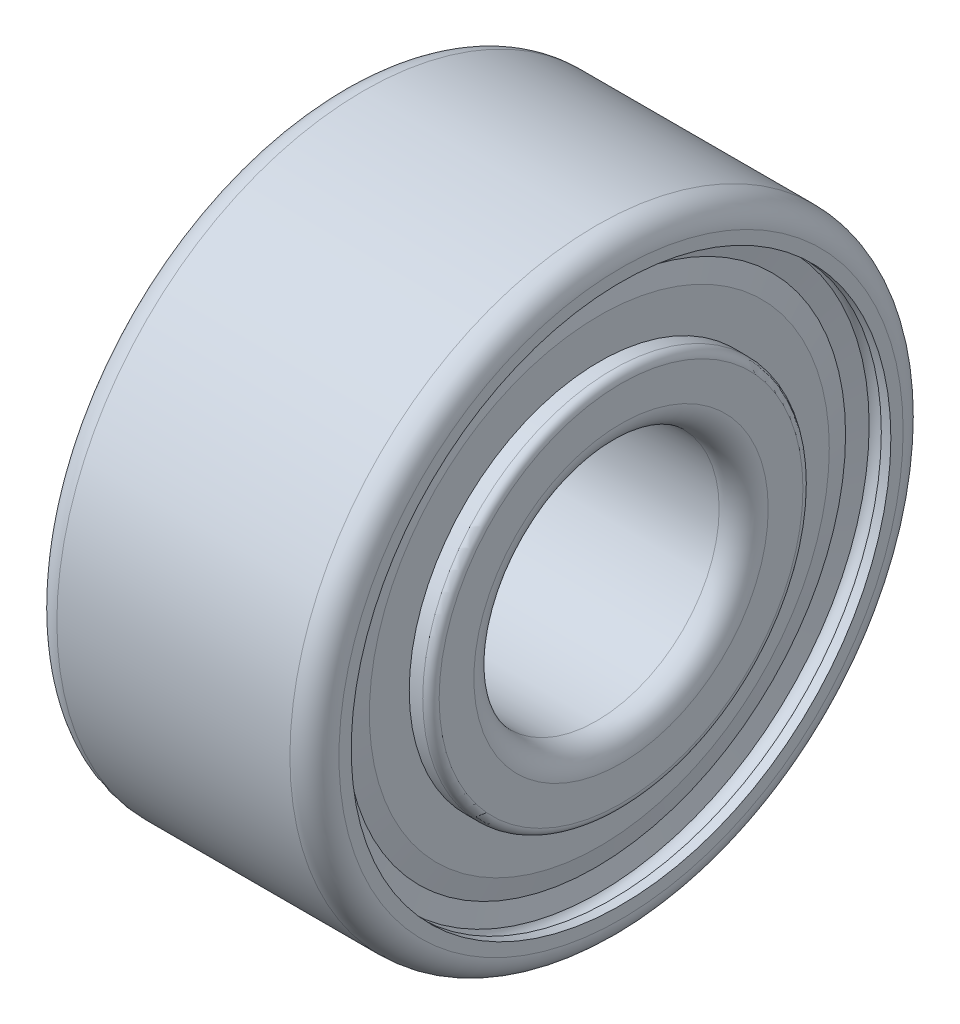
ISO-10303-21;
HEADER;
FILE_DESCRIPTION(('STEP AP214'),'2;1');
FILE_NAME('part.step','',(''),(''),'','','');
FILE_SCHEMA(('AUTOMOTIVE_DESIGN { 1 0 10303 214 1 1 1 1 }'));
ENDSEC;
DATA;
#1=APPLICATION_CONTEXT('core data for automotive mechanical design processes');
#2=APPLICATION_PROTOCOL_DEFINITION('international standard','automotive_design',2000,#1);
#3=PRODUCT_CONTEXT('',#1,'mechanical');
#4=PRODUCT('Part','Part','',(#3));
#5=PRODUCT_RELATED_PRODUCT_CATEGORY('part','',(#4));
#6=PRODUCT_DEFINITION_FORMATION('','',#4);
#7=PRODUCT_DEFINITION_CONTEXT('part definition',#1,'design');
#8=PRODUCT_DEFINITION('design','',#6,#7);
#9=PRODUCT_DEFINITION_SHAPE('','',#8);
#10=(LENGTH_UNIT() NAMED_UNIT(*) SI_UNIT(.MILLI.,.METRE.));
#11=(NAMED_UNIT(*) PLANE_ANGLE_UNIT() SI_UNIT($,.RADIAN.));
#12=(NAMED_UNIT(*) SI_UNIT($,.STERADIAN.) SOLID_ANGLE_UNIT());
#13=UNCERTAINTY_MEASURE_WITH_UNIT(LENGTH_MEASURE(1.E-05),#10,'distance_accuracy_value','');
#14=(GEOMETRIC_REPRESENTATION_CONTEXT(3) GLOBAL_UNCERTAINTY_ASSIGNED_CONTEXT((#13)) GLOBAL_UNIT_ASSIGNED_CONTEXT((#10,
#11,#12)) REPRESENTATION_CONTEXT('',''));
#15=CARTESIAN_POINT('',(0.,0.,0.));
#16=DIRECTION('',(0.,0.,1.));
#17=DIRECTION('',(1.,0.,0.));
#18=AXIS2_PLACEMENT_3D('',#15,#16,#17);
#19=CARTESIAN_POINT('',(2.0635,0.,0.));
#20=DIRECTION('',(1.,0.,0.));
#21=DIRECTION('',(0.,0.,-1.));
#22=AXIS2_PLACEMENT_3D('',#19,#20,#21);
#23=CONICAL_SURFACE('',#22,2.2,1.24961557878949);
#24=CARTESIAN_POINT('',(2.004,0.,0.));
#25=DIRECTION('',(1.,0.,0.));
#26=DIRECTION('',(0.,0.,-1.));
#27=AXIS2_PLACEMENT_3D('',#24,#25,#26);
#28=CIRCLE('',#27,2.0211603846154);
#29=CARTESIAN_POINT('',(2.004,0.,-2.0211603846154));
#30=VERTEX_POINT('',#29);
#31=EDGE_CURVE('P0_E10',#30,#30,#28,.T.);
#32=ORIENTED_EDGE('',*,*,#31,.T.);
#33=EDGE_LOOP('',(#32));
#34=FACE_BOUND('',#33,.T.);
#35=CARTESIAN_POINT('',(2.0635,0.,0.));
#36=DIRECTION('',(1.,0.,0.));
#37=DIRECTION('',(0.,0.,-1.));
#38=AXIS2_PLACEMENT_3D('',#35,#36,#37);
#39=CIRCLE('',#38,2.2);
#40=CARTESIAN_POINT('',(2.0635,0.,-2.2));
#41=VERTEX_POINT('',#40);
#42=EDGE_CURVE('P0_E43',#41,#41,#39,.T.);
#43=ORIENTED_EDGE('',*,*,#42,.F.);
#44=EDGE_LOOP('',(#43));
#45=FACE_BOUND('',#44,.T.);
#46=ADVANCED_FACE('P0_F15',(#34,#45),#23,.T.);
#47=CARTESIAN_POINT('',(2.004,2.0211603846154,0.));
#48=DIRECTION('',(-1.,0.,0.));
#49=DIRECTION('',(0.,0.,1.));
#50=AXIS2_PLACEMENT_3D('',#47,#48,#49);
#51=PLANE('',#50);
#52=CARTESIAN_POINT('',(2.004,0.,0.));
#53=DIRECTION('',(1.,0.,0.));
#54=DIRECTION('',(0.,0.,-1.));
#55=AXIS2_PLACEMENT_3D('',#52,#53,#54);
#56=CIRCLE('',#55,1.875);
#57=CARTESIAN_POINT('',(2.004,0.,-1.875));
#58=VERTEX_POINT('',#57);
#59=EDGE_CURVE('P0_E21',#58,#58,#56,.T.);
#60=ORIENTED_EDGE('',*,*,#59,.T.);
#61=EDGE_LOOP('',(#60));
#62=FACE_BOUND('',#61,.T.);
#63=ORIENTED_EDGE('',*,*,#31,.F.);
#64=EDGE_LOOP('',(#63));
#65=FACE_BOUND('',#64,.T.);
#66=ADVANCED_FACE('P0_F51',(#62,#65),#51,.T.);
#67=CARTESIAN_POINT('',(2.004,0.,0.));
#68=DIRECTION('',(-1.,0.,0.));
#69=DIRECTION('',(0.,0.,1.));
#70=AXIS2_PLACEMENT_3D('',#67,#68,#69);
#71=CONICAL_SURFACE('',#70,1.875,1.38972463594285);
#72=CARTESIAN_POINT('',(2.0635,0.,0.));
#73=DIRECTION('',(1.,0.,0.));
#74=DIRECTION('',(0.,0.,-1.));
#75=AXIS2_PLACEMENT_3D('',#72,#73,#74);
#76=CIRCLE('',#75,1.55);
#77=CARTESIAN_POINT('',(2.0635,0.,-1.55));
#78=VERTEX_POINT('',#77);
#79=EDGE_CURVE('P0_E25',#78,#78,#76,.T.);
#80=ORIENTED_EDGE('',*,*,#79,.T.);
#81=EDGE_LOOP('',(#80));
#82=FACE_BOUND('',#81,.T.);
#83=ORIENTED_EDGE('',*,*,#59,.F.);
#84=EDGE_LOOP('',(#83));
#85=FACE_BOUND('',#84,.T.);
#86=ADVANCED_FACE('P0_F56',(#82,#85),#71,.F.);
#87=CARTESIAN_POINT('',(50.,0.,0.));
#88=DIRECTION('',(1.,0.,0.));
#89=DIRECTION('',(0.,0.,-1.));
#90=AXIS2_PLACEMENT_3D('',#87,#88,#89);
#91=CYLINDRICAL_SURFACE('',#90,1.55);
#92=CARTESIAN_POINT('',(2.123,0.,0.));
#93=DIRECTION('',(1.,0.,0.));
#94=DIRECTION('',(0.,0.,-1.));
#95=AXIS2_PLACEMENT_3D('',#92,#93,#94);
#96=CIRCLE('',#95,1.55);
#97=CARTESIAN_POINT('',(2.123,0.,-1.55));
#98=VERTEX_POINT('',#97);
#99=EDGE_CURVE('P0_E29',#98,#98,#96,.T.);
#100=ORIENTED_EDGE('',*,*,#99,.T.);
#101=EDGE_LOOP('',(#100));
#102=FACE_BOUND('',#101,.T.);
#103=ORIENTED_EDGE('',*,*,#79,.F.);
#104=EDGE_LOOP('',(#103));
#105=FACE_BOUND('',#104,.T.);
#106=ADVANCED_FACE('P0_F60',(#102,#105),#91,.F.);
#107=CARTESIAN_POINT('',(2.123,1.55,0.));
#108=DIRECTION('',(1.,0.,0.));
#109=DIRECTION('',(0.,0.,-1.));
#110=AXIS2_PLACEMENT_3D('',#107,#108,#109);
#111=PLANE('',#110);
#112=CARTESIAN_POINT('',(2.123,0.,0.));
#113=DIRECTION('',(1.,0.,0.));
#114=DIRECTION('',(0.,0.,-1.));
#115=AXIS2_PLACEMENT_3D('',#112,#113,#114);
#116=CIRCLE('',#115,1.875);
#117=CARTESIAN_POINT('',(2.123,0.,-1.875));
#118=VERTEX_POINT('',#117);
#119=EDGE_CURVE('P0_E34',#118,#118,#116,.T.);
#120=ORIENTED_EDGE('',*,*,#119,.T.);
#121=EDGE_LOOP('',(#120));
#122=FACE_BOUND('',#121,.T.);
#123=ORIENTED_EDGE('',*,*,#99,.F.);
#124=EDGE_LOOP('',(#123));
#125=FACE_BOUND('',#124,.T.);
#126=ADVANCED_FACE('P0_F67',(#122,#125),#111,.T.);
#127=CARTESIAN_POINT('',(2.123,0.,0.));
#128=DIRECTION('',(-1.,0.,0.));
#129=DIRECTION('',(0.,0.,1.));
#130=AXIS2_PLACEMENT_3D('',#127,#128,#129);
#131=CONICAL_SURFACE('',#130,1.875,1.38972463594285);
#132=CARTESIAN_POINT('',(2.09325,0.,0.));
#133=DIRECTION('',(1.,0.,0.));
#134=DIRECTION('',(0.,0.,-1.));
#135=AXIS2_PLACEMENT_3D('',#132,#133,#134);
#136=CIRCLE('',#135,2.0375);
#137=CARTESIAN_POINT('',(2.09325,0.,-2.0375));
#138=VERTEX_POINT('',#137);
#139=EDGE_CURVE('P0_E37',#138,#138,#136,.T.);
#140=ORIENTED_EDGE('',*,*,#139,.T.);
#141=EDGE_LOOP('',(#140));
#142=FACE_BOUND('',#141,.T.);
#143=ORIENTED_EDGE('',*,*,#119,.F.);
#144=EDGE_LOOP('',(#143));
#145=FACE_BOUND('',#144,.T.);
#146=ADVANCED_FACE('P0_F71',(#142,#145),#131,.T.);
#147=CARTESIAN_POINT('',(2.09325,0.,0.));
#148=DIRECTION('',(1.,0.,0.));
#149=DIRECTION('',(0.,0.,-1.));
#150=AXIS2_PLACEMENT_3D('',#147,#148,#149);
#151=CONICAL_SURFACE('',#150,2.0375,1.38972463594285);
#152=CARTESIAN_POINT('',(2.123,0.,0.));
#153=DIRECTION('',(1.,0.,0.));
#154=DIRECTION('',(0.,0.,-1.));
#155=AXIS2_PLACEMENT_3D('',#152,#153,#154);
#156=CIRCLE('',#155,2.2);
#157=CARTESIAN_POINT('',(2.123,0.,-2.2));
#158=VERTEX_POINT('',#157);
#159=EDGE_CURVE('P0_E40',#158,#158,#156,.T.);
#160=ORIENTED_EDGE('',*,*,#159,.T.);
#161=EDGE_LOOP('',(#160));
#162=FACE_BOUND('',#161,.T.);
#163=ORIENTED_EDGE('',*,*,#139,.F.);
#164=EDGE_LOOP('',(#163));
#165=FACE_BOUND('',#164,.T.);
#166=ADVANCED_FACE('P0_F75',(#162,#165),#151,.F.);
#167=CARTESIAN_POINT('',(50.,0.,0.));
#168=DIRECTION('',(1.,0.,0.));
#169=DIRECTION('',(0.,0.,-1.));
#170=AXIS2_PLACEMENT_3D('',#167,#168,#169);
#171=CYLINDRICAL_SURFACE('',#170,2.2);
#172=ORIENTED_EDGE('',*,*,#42,.T.);
#173=EDGE_LOOP('',(#172));
#174=FACE_BOUND('',#173,.T.);
#175=ORIENTED_EDGE('',*,*,#159,.F.);
#176=EDGE_LOOP('',(#175));
#177=FACE_BOUND('',#176,.T.);
#178=ADVANCED_FACE('P0_F47',(#174,#177),#171,.T.);
#179=CLOSED_SHELL('',(#46,#66,#86,#106,#126,#146,#166,#178));
#180=MANIFOLD_SOLID_BREP('P0_B1',#179);
#181=CARTESIAN_POINT('',(0.200000000000017,0.,0.));
#182=DIRECTION('',(1.,0.,0.));
#183=DIRECTION('',(0.,0.,-1.));
#184=AXIS2_PLACEMENT_3D('',#181,#182,#183);
#185=TOROIDAL_SURFACE('',#184,1.20000000000002,0.200000000000017);
#186=CARTESIAN_POINT('',(0.2,0.,0.));
#187=DIRECTION('',(1.,0.,0.));
#188=DIRECTION('',(0.,0.,-1.));
#189=AXIS2_PLACEMENT_3D('',#186,#187,#188);
#190=CIRCLE('',#189,1.);
#191=CARTESIAN_POINT('',(0.2,0.,-1.));
#192=VERTEX_POINT('',#191);
#193=EDGE_CURVE('P1_E10',#192,#192,#190,.T.);
#194=ORIENTED_EDGE('',*,*,#193,.T.);
#195=EDGE_LOOP('',(#194));
#196=FACE_BOUND('',#195,.T.);
#197=CARTESIAN_POINT('',(0.,0.,0.));
#198=DIRECTION('',(1.,0.,0.));
#199=DIRECTION('',(0.,0.,-1.));
#200=AXIS2_PLACEMENT_3D('',#197,#198,#199);
#201=CIRCLE('',#200,1.2);
#202=CARTESIAN_POINT('',(0.,0.,-1.2));
#203=VERTEX_POINT('',#202);
#204=EDGE_CURVE('P1_E49',#203,#203,#201,.T.);
#205=ORIENTED_EDGE('',*,*,#204,.F.);
#206=EDGE_LOOP('',(#205));
#207=FACE_BOUND('',#206,.T.);
#208=ADVANCED_FACE('P1_F15',(#196,#207),#185,.T.);
#209=CARTESIAN_POINT('',(2.1,0.,0.));
#210=DIRECTION('',(1.,0.,0.));
#211=DIRECTION('',(0.,0.,-1.));
#212=AXIS2_PLACEMENT_3D('',#209,#210,#211);
#213=CYLINDRICAL_SURFACE('',#212,1.);
#214=CARTESIAN_POINT('',(2.1,0.,0.));
#215=DIRECTION('',(1.,0.,0.));
#216=DIRECTION('',(0.,0.,-1.));
#217=AXIS2_PLACEMENT_3D('',#214,#215,#216);
#218=CIRCLE('',#217,1.);
#219=CARTESIAN_POINT('',(2.1,0.,-1.));
#220=VERTEX_POINT('',#219);
#221=EDGE_CURVE('P1_E21',#220,#220,#218,.T.);
#222=ORIENTED_EDGE('',*,*,#221,.T.);
#223=EDGE_LOOP('',(#222));
#224=FACE_BOUND('',#223,.T.);
#225=ORIENTED_EDGE('',*,*,#193,.F.);
#226=EDGE_LOOP('',(#225));
#227=FACE_BOUND('',#226,.T.);
#228=ADVANCED_FACE('P1_F57',(#224,#227),#213,.F.);
#229=CARTESIAN_POINT('',(2.09999999999997,0.,0.));
#230=DIRECTION('',(1.,0.,0.));
#231=DIRECTION('',(0.,0.,-1.));
#232=AXIS2_PLACEMENT_3D('',#229,#230,#231);
#233=TOROIDAL_SURFACE('',#232,1.20000000000003,0.200000000000032);
#234=CARTESIAN_POINT('',(2.3,0.,0.));
#235=DIRECTION('',(1.,0.,0.));
#236=DIRECTION('',(0.,0.,-1.));
#237=AXIS2_PLACEMENT_3D('',#234,#235,#236);
#238=CIRCLE('',#237,1.2);
#239=CARTESIAN_POINT('',(2.3,0.,-1.2));
#240=VERTEX_POINT('',#239);
#241=EDGE_CURVE('P1_E25',#240,#240,#238,.T.);
#242=ORIENTED_EDGE('',*,*,#241,.T.);
#243=EDGE_LOOP('',(#242));
#244=FACE_BOUND('',#243,.T.);
#245=ORIENTED_EDGE('',*,*,#221,.F.);
#246=EDGE_LOOP('',(#245));
#247=FACE_BOUND('',#246,.T.);
#248=ADVANCED_FACE('P1_F62',(#244,#247),#233,.T.);
#249=CARTESIAN_POINT('',(2.3,1.2,0.));
#250=DIRECTION('',(1.,0.,0.));
#251=DIRECTION('',(0.,0.,-1.));
#252=AXIS2_PLACEMENT_3D('',#249,#250,#251);
#253=PLANE('',#252);
#254=CARTESIAN_POINT('',(2.3,0.,0.));
#255=DIRECTION('',(1.,0.,0.));
#256=DIRECTION('',(0.,0.,-1.));
#257=AXIS2_PLACEMENT_3D('',#254,#255,#256);
#258=CIRCLE('',#257,1.483);
#259=CARTESIAN_POINT('',(2.3,0.,-1.483));
#260=VERTEX_POINT('',#259);
#261=EDGE_CURVE('P1_E29',#260,#260,#258,.T.);
#262=ORIENTED_EDGE('',*,*,#261,.T.);
#263=EDGE_LOOP('',(#262));
#264=FACE_BOUND('',#263,.T.);
#265=ORIENTED_EDGE('',*,*,#241,.F.);
#266=EDGE_LOOP('',(#265));
#267=FACE_BOUND('',#266,.T.);
#268=ADVANCED_FACE('P1_F66',(#264,#267),#253,.T.);
#269=CARTESIAN_POINT('',(2.233,0.,0.));
#270=DIRECTION('',(1.,0.,0.));
#271=DIRECTION('',(0.,0.,-1.));
#272=AXIS2_PLACEMENT_3D('',#269,#270,#271);
#273=TOROIDAL_SURFACE('',#272,1.483,0.0669999999999951);
#274=CARTESIAN_POINT('',(2.233,0.,0.));
#275=DIRECTION('',(1.,0.,0.));
#276=DIRECTION('',(0.,0.,-1.));
#277=AXIS2_PLACEMENT_3D('',#274,#275,#276);
#278=CIRCLE('',#277,1.55);
#279=CARTESIAN_POINT('',(2.233,0.,-1.55));
#280=VERTEX_POINT('',#279);
#281=EDGE_CURVE('P1_E34',#280,#280,#278,.T.);
#282=ORIENTED_EDGE('',*,*,#281,.T.);
#283=EDGE_LOOP('',(#282));
#284=FACE_BOUND('',#283,.T.);
#285=ORIENTED_EDGE('',*,*,#261,.F.);
#286=EDGE_LOOP('',(#285));
#287=FACE_BOUND('',#286,.T.);
#288=ADVANCED_FACE('P1_F73',(#284,#287),#273,.T.);
#289=CARTESIAN_POINT('',(2.1,0.,0.));
#290=DIRECTION('',(1.,0.,0.));
#291=DIRECTION('',(0.,0.,-1.));
#292=AXIS2_PLACEMENT_3D('',#289,#290,#291);
#293=CYLINDRICAL_SURFACE('',#292,1.55);
#294=CARTESIAN_POINT('',(1.5372983346207,0.,0.));
#295=DIRECTION('',(1.,0.,0.));
#296=DIRECTION('',(0.,0.,-1.));
#297=AXIS2_PLACEMENT_3D('',#294,#295,#296);
#298=CIRCLE('',#297,1.55);
#299=CARTESIAN_POINT('',(1.5372983346207,0.,-1.55));
#300=VERTEX_POINT('',#299);
#301=EDGE_CURVE('P1_E37',#300,#300,#298,.T.);
#302=ORIENTED_EDGE('',*,*,#301,.T.);
#303=EDGE_LOOP('',(#302));
#304=FACE_BOUND('',#303,.T.);
#305=ORIENTED_EDGE('',*,*,#281,.F.);
#306=EDGE_LOOP('',(#305));
#307=FACE_BOUND('',#306,.T.);
#308=ADVANCED_FACE('P1_F77',(#304,#307),#293,.T.);
#309=CARTESIAN_POINT('',(1.14999999999998,0.,0.));
#310=DIRECTION('',(1.,0.,0.));
#311=DIRECTION('',(0.,0.,-1.));
#312=AXIS2_PLACEMENT_3D('',#309,#310,#311);
#313=TOROIDAL_SURFACE('',#312,1.64999999999997,0.399999999999972);
#314=CARTESIAN_POINT('',(0.76270166537926,0.,0.));
#315=DIRECTION('',(1.,0.,0.));
#316=DIRECTION('',(0.,0.,-1.));
#317=AXIS2_PLACEMENT_3D('',#314,#315,#316);
#318=CIRCLE('',#317,1.55);
#319=CARTESIAN_POINT('',(0.76270166537926,0.,-1.55));
#320=VERTEX_POINT('',#319);
#321=EDGE_CURVE('P1_E40',#320,#320,#318,.T.);
#322=ORIENTED_EDGE('',*,*,#321,.T.);
#323=EDGE_LOOP('',(#322));
#324=FACE_BOUND('',#323,.T.);
#325=ORIENTED_EDGE('',*,*,#301,.F.);
#326=EDGE_LOOP('',(#325));
#327=FACE_BOUND('',#326,.T.);
#328=ADVANCED_FACE('P1_F81',(#324,#327),#313,.F.);
#329=CARTESIAN_POINT('',(2.1,0.,0.));
#330=DIRECTION('',(1.,0.,0.));
#331=DIRECTION('',(0.,0.,-1.));
#332=AXIS2_PLACEMENT_3D('',#329,#330,#331);
#333=CYLINDRICAL_SURFACE('',#332,1.55);
#334=CARTESIAN_POINT('',(0.0669999999999998,0.,0.));
#335=DIRECTION('',(1.,0.,0.));
#336=DIRECTION('',(0.,0.,-1.));
#337=AXIS2_PLACEMENT_3D('',#334,#335,#336);
#338=CIRCLE('',#337,1.55);
#339=CARTESIAN_POINT('',(0.0669999999999998,0.,-1.55));
#340=VERTEX_POINT('',#339);
#341=EDGE_CURVE('P1_E43',#340,#340,#338,.T.);
#342=ORIENTED_EDGE('',*,*,#341,.T.);
#343=EDGE_LOOP('',(#342));
#344=FACE_BOUND('',#343,.T.);
#345=ORIENTED_EDGE('',*,*,#321,.F.);
#346=EDGE_LOOP('',(#345));
#347=FACE_BOUND('',#346,.T.);
#348=ADVANCED_FACE('P1_F85',(#344,#347),#333,.T.);
#349=CARTESIAN_POINT('',(0.0669999999999973,0.,0.));
#350=DIRECTION('',(1.,0.,0.));
#351=DIRECTION('',(0.,0.,-1.));
#352=AXIS2_PLACEMENT_3D('',#349,#350,#351);
#353=TOROIDAL_SURFACE('',#352,1.483,0.0669999999999973);
#354=CARTESIAN_POINT('',(0.,0.,0.));
#355=DIRECTION('',(1.,0.,0.));
#356=DIRECTION('',(0.,0.,-1.));
#357=AXIS2_PLACEMENT_3D('',#354,#355,#356);
#358=CIRCLE('',#357,1.483);
#359=CARTESIAN_POINT('',(0.,0.,-1.483));
#360=VERTEX_POINT('',#359);
#361=EDGE_CURVE('P1_E46',#360,#360,#358,.T.);
#362=ORIENTED_EDGE('',*,*,#361,.T.);
#363=EDGE_LOOP('',(#362));
#364=FACE_BOUND('',#363,.T.);
#365=ORIENTED_EDGE('',*,*,#341,.F.);
#366=EDGE_LOOP('',(#365));
#367=FACE_BOUND('',#366,.T.);
#368=ADVANCED_FACE('P1_F89',(#364,#367),#353,.T.);
#369=CARTESIAN_POINT('',(0.,1.483,0.));
#370=DIRECTION('',(-1.,0.,0.));
#371=DIRECTION('',(0.,0.,1.));
#372=AXIS2_PLACEMENT_3D('',#369,#370,#371);
#373=PLANE('',#372);
#374=ORIENTED_EDGE('',*,*,#204,.T.);
#375=EDGE_LOOP('',(#374));
#376=FACE_BOUND('',#375,.T.);
#377=ORIENTED_EDGE('',*,*,#361,.F.);
#378=EDGE_LOOP('',(#377));
#379=FACE_BOUND('',#378,.T.);
#380=ADVANCED_FACE('P1_F53',(#376,#379),#373,.T.);
#381=CLOSED_SHELL('',(#208,#228,#248,#268,#288,#308,#328,#348,#368,#380));
#382=MANIFOLD_SOLID_BREP('P1_B1',#381);
#383=CARTESIAN_POINT('',(0.178,1.875,0.));
#384=DIRECTION('',(1.,0.,0.));
#385=DIRECTION('',(0.,0.,-1.));
#386=AXIS2_PLACEMENT_3D('',#383,#384,#385);
#387=PLANE('',#386);
#388=CARTESIAN_POINT('',(0.178,0.,0.));
#389=DIRECTION('',(-1.,0.,0.));
#390=DIRECTION('',(0.,0.,1.));
#391=AXIS2_PLACEMENT_3D('',#388,#389,#390);
#392=CIRCLE('',#391,1.55);
#393=CARTESIAN_POINT('',(0.178,0.,1.55));
#394=VERTEX_POINT('',#393);
#395=EDGE_CURVE('P2_E10',#394,#394,#392,.T.);
#396=ORIENTED_EDGE('',*,*,#395,.F.);
#397=EDGE_LOOP('',(#396));
#398=FACE_BOUND('',#397,.T.);
#399=CARTESIAN_POINT('',(0.178,0.,0.));
#400=DIRECTION('',(-1.,0.,0.));
#401=DIRECTION('',(0.,0.,1.));
#402=AXIS2_PLACEMENT_3D('',#399,#400,#401);
#403=CIRCLE('',#402,1.875);
#404=CARTESIAN_POINT('',(0.178,0.,1.875));
#405=VERTEX_POINT('',#404);
#406=EDGE_CURVE('P2_E43',#405,#405,#403,.T.);
#407=ORIENTED_EDGE('',*,*,#406,.T.);
#408=EDGE_LOOP('',(#407));
#409=FACE_BOUND('',#408,.T.);
#410=ADVANCED_FACE('P2_F15',(#398,#409),#387,.F.);
#411=CARTESIAN_POINT('',(0.2375,0.,0.));
#412=DIRECTION('',(-1.,0.,0.));
#413=DIRECTION('',(0.,0.,1.));
#414=AXIS2_PLACEMENT_3D('',#411,#412,#413);
#415=CYLINDRICAL_SURFACE('',#414,1.55);
#416=CARTESIAN_POINT('',(0.2375,0.,0.));
#417=DIRECTION('',(-1.,0.,0.));
#418=DIRECTION('',(0.,0.,1.));
#419=AXIS2_PLACEMENT_3D('',#416,#417,#418);
#420=CIRCLE('',#419,1.55);
#421=CARTESIAN_POINT('',(0.2375,0.,1.55));
#422=VERTEX_POINT('',#421);
#423=EDGE_CURVE('P2_E21',#422,#422,#420,.T.);
#424=ORIENTED_EDGE('',*,*,#423,.F.);
#425=EDGE_LOOP('',(#424));
#426=FACE_BOUND('',#425,.T.);
#427=ORIENTED_EDGE('',*,*,#395,.T.);
#428=EDGE_LOOP('',(#427));
#429=FACE_BOUND('',#428,.T.);
#430=ADVANCED_FACE('P2_F80',(#426,#429),#415,.F.);
#431=CARTESIAN_POINT('',(0.2375,0.,0.));
#432=DIRECTION('',(1.,0.,0.));
#433=DIRECTION('',(0.,0.,-1.));
#434=AXIS2_PLACEMENT_3D('',#431,#432,#433);
#435=CONICAL_SURFACE('',#434,1.55,1.38972463594286);
#436=CARTESIAN_POINT('',(0.297,0.,0.));
#437=DIRECTION('',(-1.,0.,0.));
#438=DIRECTION('',(0.,0.,1.));
#439=AXIS2_PLACEMENT_3D('',#436,#437,#438);
#440=CIRCLE('',#439,1.875);
#441=CARTESIAN_POINT('',(0.297,0.,1.875));
#442=VERTEX_POINT('',#441);
#443=EDGE_CURVE('P2_E25',#442,#442,#440,.T.);
#444=ORIENTED_EDGE('',*,*,#443,.F.);
#445=EDGE_LOOP('',(#444));
#446=FACE_BOUND('',#445,.T.);
#447=ORIENTED_EDGE('',*,*,#423,.T.);
#448=EDGE_LOOP('',(#447));
#449=FACE_BOUND('',#448,.T.);
#450=ADVANCED_FACE('P2_F75',(#446,#449),#435,.F.);
#451=CARTESIAN_POINT('',(0.297,1.875,0.));
#452=DIRECTION('',(-1.,0.,0.));
#453=DIRECTION('',(0.,0.,1.));
#454=AXIS2_PLACEMENT_3D('',#451,#452,#453);
#455=PLANE('',#454);
#456=CARTESIAN_POINT('',(0.297,0.,0.));
#457=DIRECTION('',(-1.,0.,0.));
#458=DIRECTION('',(0.,0.,1.));
#459=AXIS2_PLACEMENT_3D('',#456,#457,#458);
#460=CIRCLE('',#459,2.0211603846154);
#461=CARTESIAN_POINT('',(0.297,0.,2.0211603846154));
#462=VERTEX_POINT('',#461);
#463=EDGE_CURVE('P2_E29',#462,#462,#460,.T.);
#464=ORIENTED_EDGE('',*,*,#463,.F.);
#465=EDGE_LOOP('',(#464));
#466=FACE_BOUND('',#465,.T.);
#467=ORIENTED_EDGE('',*,*,#443,.T.);
#468=EDGE_LOOP('',(#467));
#469=FACE_BOUND('',#468,.T.);
#470=ADVANCED_FACE('P2_F69',(#466,#469),#455,.F.);
#471=CARTESIAN_POINT('',(0.297,0.,0.));
#472=DIRECTION('',(-1.,0.,0.));
#473=DIRECTION('',(0.,0.,1.));
#474=AXIS2_PLACEMENT_3D('',#471,#472,#473);
#475=CONICAL_SURFACE('',#474,2.0211603846154,1.24961557878951);
#476=CARTESIAN_POINT('',(0.2375,0.,0.));
#477=DIRECTION('',(-1.,0.,0.));
#478=DIRECTION('',(0.,0.,1.));
#479=AXIS2_PLACEMENT_3D('',#476,#477,#478);
#480=CIRCLE('',#479,2.2);
#481=CARTESIAN_POINT('',(0.2375,0.,2.2));
#482=VERTEX_POINT('',#481);
#483=EDGE_CURVE('P2_E34',#482,#482,#480,.T.);
#484=ORIENTED_EDGE('',*,*,#483,.F.);
#485=EDGE_LOOP('',(#484));
#486=FACE_BOUND('',#485,.T.);
#487=ORIENTED_EDGE('',*,*,#463,.T.);
#488=EDGE_LOOP('',(#487));
#489=FACE_BOUND('',#488,.T.);
#490=ADVANCED_FACE('P2_F63',(#486,#489),#475,.T.);
#491=CARTESIAN_POINT('',(0.2375,0.,0.));
#492=DIRECTION('',(-1.,0.,0.));
#493=DIRECTION('',(0.,0.,1.));
#494=AXIS2_PLACEMENT_3D('',#491,#492,#493);
#495=CYLINDRICAL_SURFACE('',#494,2.2);
#496=CARTESIAN_POINT('',(0.178,0.,0.));
#497=DIRECTION('',(-1.,0.,0.));
#498=DIRECTION('',(0.,0.,1.));
#499=AXIS2_PLACEMENT_3D('',#496,#497,#498);
#500=CIRCLE('',#499,2.2);
#501=CARTESIAN_POINT('',(0.178,0.,2.2));
#502=VERTEX_POINT('',#501);
#503=EDGE_CURVE('P2_E37',#502,#502,#500,.T.);
#504=ORIENTED_EDGE('',*,*,#503,.F.);
#505=EDGE_LOOP('',(#504));
#506=FACE_BOUND('',#505,.T.);
#507=ORIENTED_EDGE('',*,*,#483,.T.);
#508=EDGE_LOOP('',(#507));
#509=FACE_BOUND('',#508,.T.);
#510=ADVANCED_FACE('P2_F57',(#506,#509),#495,.T.);
#511=CARTESIAN_POINT('',(0.178,0.,0.));
#512=DIRECTION('',(-1.,0.,0.));
#513=DIRECTION('',(0.,0.,1.));
#514=AXIS2_PLACEMENT_3D('',#511,#512,#513);
#515=CONICAL_SURFACE('',#514,2.2,1.38972463594286);
#516=CARTESIAN_POINT('',(0.20775,0.,0.));
#517=DIRECTION('',(-1.,0.,0.));
#518=DIRECTION('',(0.,0.,1.));
#519=AXIS2_PLACEMENT_3D('',#516,#517,#518);
#520=CIRCLE('',#519,2.0375);
#521=CARTESIAN_POINT('',(0.20775,0.,2.0375));
#522=VERTEX_POINT('',#521);
#523=EDGE_CURVE('P2_E40',#522,#522,#520,.T.);
#524=ORIENTED_EDGE('',*,*,#523,.F.);
#525=EDGE_LOOP('',(#524));
#526=FACE_BOUND('',#525,.T.);
#527=ORIENTED_EDGE('',*,*,#503,.T.);
#528=EDGE_LOOP('',(#527));
#529=FACE_BOUND('',#528,.T.);
#530=ADVANCED_FACE('P2_F51',(#526,#529),#515,.F.);
#531=CARTESIAN_POINT('',(0.20775,0.,0.));
#532=DIRECTION('',(1.,0.,0.));
#533=DIRECTION('',(0.,0.,-1.));
#534=AXIS2_PLACEMENT_3D('',#531,#532,#533);
#535=CONICAL_SURFACE('',#534,2.0375,1.38972463594286);
#536=ORIENTED_EDGE('',*,*,#406,.F.);
#537=EDGE_LOOP('',(#536));
#538=FACE_BOUND('',#537,.T.);
#539=ORIENTED_EDGE('',*,*,#523,.T.);
#540=EDGE_LOOP('',(#539));
#541=FACE_BOUND('',#540,.T.);
#542=ADVANCED_FACE('P2_F48',(#538,#541),#535,.T.);
#543=CLOSED_SHELL('',(#410,#430,#450,#470,#490,#510,#530,#542));
#544=MANIFOLD_SOLID_BREP('P2_B1',#543);
#545=CARTESIAN_POINT('',(0.200000000000017,0.,0.));
#546=DIRECTION('',(1.,0.,0.));
#547=DIRECTION('',(0.,0.,-1.));
#548=AXIS2_PLACEMENT_3D('',#545,#546,#547);
#549=TOROIDAL_SURFACE('',#548,2.29999999999998,0.200000000000017);
#550=CARTESIAN_POINT('',(0.,0.,0.));
#551=DIRECTION('',(1.,0.,0.));
#552=DIRECTION('',(0.,0.,-1.));
#553=AXIS2_PLACEMENT_3D('',#550,#551,#552);
#554=CIRCLE('',#553,2.3);
#555=CARTESIAN_POINT('',(0.,0.,-2.3));
#556=VERTEX_POINT('',#555);
#557=EDGE_CURVE('P3_E10',#556,#556,#554,.T.);
#558=ORIENTED_EDGE('',*,*,#557,.T.);
#559=EDGE_LOOP('',(#558));
#560=FACE_BOUND('',#559,.T.);
#561=CARTESIAN_POINT('',(0.2,0.,0.));
#562=DIRECTION('',(1.,0.,0.));
#563=DIRECTION('',(0.,0.,-1.));
#564=AXIS2_PLACEMENT_3D('',#561,#562,#563);
#565=CIRCLE('',#564,2.5);
#566=CARTESIAN_POINT('',(0.2,0.,-2.5));
#567=VERTEX_POINT('',#566);
#568=EDGE_CURVE('P3_E61',#567,#567,#565,.T.);
#569=ORIENTED_EDGE('',*,*,#568,.F.);
#570=EDGE_LOOP('',(#569));
#571=FACE_BOUND('',#570,.T.);
#572=ADVANCED_FACE('P3_F15',(#560,#571),#549,.T.);
#573=CARTESIAN_POINT('',(0.,2.3,0.));
#574=DIRECTION('',(-1.,0.,0.));
#575=DIRECTION('',(0.,0.,1.));
#576=AXIS2_PLACEMENT_3D('',#573,#574,#575);
#577=PLANE('',#576);
#578=CARTESIAN_POINT('',(0.,0.,0.));
#579=DIRECTION('',(1.,0.,0.));
#580=DIRECTION('',(0.,0.,-1.));
#581=AXIS2_PLACEMENT_3D('',#578,#579,#580);
#582=CIRCLE('',#581,2.2);
#583=CARTESIAN_POINT('',(0.,0.,-2.2));
#584=VERTEX_POINT('',#583);
#585=EDGE_CURVE('P3_E21',#584,#584,#582,.T.);
#586=ORIENTED_EDGE('',*,*,#585,.T.);
#587=EDGE_LOOP('',(#586));
#588=FACE_BOUND('',#587,.T.);
#589=ORIENTED_EDGE('',*,*,#557,.F.);
#590=EDGE_LOOP('',(#589));
#591=FACE_BOUND('',#590,.T.);
#592=ADVANCED_FACE('P3_F69',(#588,#591),#577,.T.);
#593=CARTESIAN_POINT('',(2.1,0.,0.));
#594=DIRECTION('',(1.,0.,0.));
#595=DIRECTION('',(0.,0.,-1.));
#596=AXIS2_PLACEMENT_3D('',#593,#594,#595);
#597=CYLINDRICAL_SURFACE('',#596,2.2);
#598=CARTESIAN_POINT('',(0.0777777777777769,0.,0.));
#599=DIRECTION('',(1.,0.,0.));
#600=DIRECTION('',(0.,0.,-1.));
#601=AXIS2_PLACEMENT_3D('',#598,#599,#600);
#602=CIRCLE('',#601,2.2);
#603=CARTESIAN_POINT('',(0.0777777777777769,0.,-2.2));
#604=VERTEX_POINT('',#603);
#605=EDGE_CURVE('P3_E25',#604,#604,#602,.T.);
#606=ORIENTED_EDGE('',*,*,#605,.T.);
#607=EDGE_LOOP('',(#606));
#608=FACE_BOUND('',#607,.T.);
#609=ORIENTED_EDGE('',*,*,#585,.F.);
#610=EDGE_LOOP('',(#609));
#611=FACE_BOUND('',#610,.T.);
#612=ADVANCED_FACE('P3_F74',(#608,#611),#597,.F.);
#613=CARTESIAN_POINT('',(0.177777777777778,0.,0.));
#614=DIRECTION('',(1.,0.,0.));
#615=DIRECTION('',(0.,0.,-1.));
#616=AXIS2_PLACEMENT_3D('',#613,#614,#615);
#617=TOROIDAL_SURFACE('',#616,2.2,0.100000000000002);
#618=CARTESIAN_POINT('',(0.27777777777778,0.,0.));
#619=DIRECTION('',(1.,0.,0.));
#620=DIRECTION('',(0.,0.,-1.));
#621=AXIS2_PLACEMENT_3D('',#618,#619,#620);
#622=CIRCLE('',#621,2.2);
#623=CARTESIAN_POINT('',(0.27777777777778,0.,-2.2));
#624=VERTEX_POINT('',#623);
#625=EDGE_CURVE('P3_E29',#624,#624,#622,.T.);
#626=ORIENTED_EDGE('',*,*,#625,.T.);
#627=EDGE_LOOP('',(#626));
#628=FACE_BOUND('',#627,.T.);
#629=ORIENTED_EDGE('',*,*,#605,.F.);
#630=EDGE_LOOP('',(#629));
#631=FACE_BOUND('',#630,.T.);
#632=ADVANCED_FACE('P3_F78',(#628,#631),#617,.F.);
#633=CARTESIAN_POINT('',(0.27777777777778,0.,0.));
#634=DIRECTION('',(-1.,0.,0.));
#635=DIRECTION('',(0.,0.,1.));
#636=AXIS2_PLACEMENT_3D('',#633,#634,#635);
#637=CONICAL_SURFACE('',#636,2.2,1.39626340159549);
#638=CARTESIAN_POINT('',(0.32185952295489,0.,0.));
#639=DIRECTION('',(1.,0.,0.));
#640=DIRECTION('',(0.,0.,-1.));
#641=AXIS2_PLACEMENT_3D('',#638,#639,#640);
#642=CIRCLE('',#641,1.95);
#643=CARTESIAN_POINT('',(0.32185952295489,0.,-1.95));
#644=VERTEX_POINT('',#643);
#645=EDGE_CURVE('P3_E34',#644,#644,#642,.T.);
#646=ORIENTED_EDGE('',*,*,#645,.T.);
#647=EDGE_LOOP('',(#646));
#648=FACE_BOUND('',#647,.T.);
#649=ORIENTED_EDGE('',*,*,#625,.F.);
#650=EDGE_LOOP('',(#649));
#651=FACE_BOUND('',#650,.T.);
#652=ADVANCED_FACE('P3_F85',(#648,#651),#637,.F.);
#653=CARTESIAN_POINT('',(2.1,0.,0.));
#654=DIRECTION('',(1.,0.,0.));
#655=DIRECTION('',(0.,0.,-1.));
#656=AXIS2_PLACEMENT_3D('',#653,#654,#655);
#657=CYLINDRICAL_SURFACE('',#656,1.95);
#658=CARTESIAN_POINT('',(0.88542486889354,0.,0.));
#659=DIRECTION('',(1.,0.,0.));
#660=DIRECTION('',(0.,0.,-1.));
#661=AXIS2_PLACEMENT_3D('',#658,#659,#660);
#662=CIRCLE('',#661,1.95);
#663=CARTESIAN_POINT('',(0.88542486889354,0.,-1.95));
#664=VERTEX_POINT('',#663);
#665=EDGE_CURVE('P3_E37',#664,#664,#662,.T.);
#666=ORIENTED_EDGE('',*,*,#665,.T.);
#667=EDGE_LOOP('',(#666));
#668=FACE_BOUND('',#667,.T.);
#669=ORIENTED_EDGE('',*,*,#645,.F.);
#670=EDGE_LOOP('',(#669));
#671=FACE_BOUND('',#670,.T.);
#672=ADVANCED_FACE('P3_F89',(#668,#671),#657,.F.);
#673=CARTESIAN_POINT('',(1.15000000000002,0.,0.));
#674=DIRECTION('',(1.,0.,0.));
#675=DIRECTION('',(0.,0.,-1.));
#676=AXIS2_PLACEMENT_3D('',#673,#674,#675);
#677=TOROIDAL_SURFACE('',#676,1.64999999999995,0.400000000000055);
#678=CARTESIAN_POINT('',(1.4145751311065,0.,0.));
#679=DIRECTION('',(1.,0.,0.));
#680=DIRECTION('',(0.,0.,-1.));
#681=AXIS2_PLACEMENT_3D('',#678,#679,#680);
#682=CIRCLE('',#681,1.95);
#683=CARTESIAN_POINT('',(1.4145751311065,0.,-1.95));
#684=VERTEX_POINT('',#683);
#685=EDGE_CURVE('P3_E40',#684,#684,#682,.T.);
#686=ORIENTED_EDGE('',*,*,#685,.T.);
#687=EDGE_LOOP('',(#686));
#688=FACE_BOUND('',#687,.T.);
#689=ORIENTED_EDGE('',*,*,#665,.F.);
#690=EDGE_LOOP('',(#689));
#691=FACE_BOUND('',#690,.T.);
#692=ADVANCED_FACE('P3_F93',(#688,#691),#677,.F.);
#693=CARTESIAN_POINT('',(2.1,0.,0.));
#694=DIRECTION('',(1.,0.,0.));
#695=DIRECTION('',(0.,0.,-1.));
#696=AXIS2_PLACEMENT_3D('',#693,#694,#695);
#697=CYLINDRICAL_SURFACE('',#696,1.95);
#698=CARTESIAN_POINT('',(1.9781404770451,0.,0.));
#699=DIRECTION('',(1.,0.,0.));
#700=DIRECTION('',(0.,0.,-1.));
#701=AXIS2_PLACEMENT_3D('',#698,#699,#700);
#702=CIRCLE('',#701,1.95);
#703=CARTESIAN_POINT('',(1.9781404770451,0.,-1.95));
#704=VERTEX_POINT('',#703);
#705=EDGE_CURVE('P3_E43',#704,#704,#702,.T.);
#706=ORIENTED_EDGE('',*,*,#705,.T.);
#707=EDGE_LOOP('',(#706));
#708=FACE_BOUND('',#707,.T.);
#709=ORIENTED_EDGE('',*,*,#685,.F.);
#710=EDGE_LOOP('',(#709));
#711=FACE_BOUND('',#710,.T.);
#712=ADVANCED_FACE('P3_F97',(#708,#711),#697,.F.);
#713=CARTESIAN_POINT('',(1.9781404770451,0.,0.));
#714=DIRECTION('',(1.,0.,0.));
#715=DIRECTION('',(0.,0.,-1.));
#716=AXIS2_PLACEMENT_3D('',#713,#714,#715);
#717=CONICAL_SURFACE('',#716,1.95,1.39626340159553);
#718=CARTESIAN_POINT('',(2.0222222222222,0.,0.));
#719=DIRECTION('',(1.,0.,0.));
#720=DIRECTION('',(0.,0.,-1.));
#721=AXIS2_PLACEMENT_3D('',#718,#719,#720);
#722=CIRCLE('',#721,2.2);
#723=CARTESIAN_POINT('',(2.0222222222222,0.,-2.2));
#724=VERTEX_POINT('',#723);
#725=EDGE_CURVE('P3_E46',#724,#724,#722,.T.);
#726=ORIENTED_EDGE('',*,*,#725,.T.);
#727=EDGE_LOOP('',(#726));
#728=FACE_BOUND('',#727,.T.);
#729=ORIENTED_EDGE('',*,*,#705,.F.);
#730=EDGE_LOOP('',(#729));
#731=FACE_BOUND('',#730,.T.);
#732=ADVANCED_FACE('P3_F101',(#728,#731),#717,.F.);
#733=CARTESIAN_POINT('',(2.1222222222222,0.,0.));
#734=DIRECTION('',(1.,0.,0.));
#735=DIRECTION('',(0.,0.,-1.));
#736=AXIS2_PLACEMENT_3D('',#733,#734,#735);
#737=TOROIDAL_SURFACE('',#736,2.2,0.1);
#738=CARTESIAN_POINT('',(2.2222222222222,0.,0.));
#739=DIRECTION('',(1.,0.,0.));
#740=DIRECTION('',(0.,0.,-1.));
#741=AXIS2_PLACEMENT_3D('',#738,#739,#740);
#742=CIRCLE('',#741,2.2);
#743=CARTESIAN_POINT('',(2.2222222222222,0.,-2.2));
#744=VERTEX_POINT('',#743);
#745=EDGE_CURVE('P3_E49',#744,#744,#742,.T.);
#746=ORIENTED_EDGE('',*,*,#745,.T.);
#747=EDGE_LOOP('',(#746));
#748=FACE_BOUND('',#747,.T.);
#749=ORIENTED_EDGE('',*,*,#725,.F.);
#750=EDGE_LOOP('',(#749));
#751=FACE_BOUND('',#750,.T.);
#752=ADVANCED_FACE('P3_F105',(#748,#751),#737,.F.);
#753=CARTESIAN_POINT('',(2.1,0.,0.));
#754=DIRECTION('',(1.,0.,0.));
#755=DIRECTION('',(0.,0.,-1.));
#756=AXIS2_PLACEMENT_3D('',#753,#754,#755);
#757=CYLINDRICAL_SURFACE('',#756,2.2);
#758=CARTESIAN_POINT('',(2.3,0.,0.));
#759=DIRECTION('',(1.,0.,0.));
#760=DIRECTION('',(0.,0.,-1.));
#761=AXIS2_PLACEMENT_3D('',#758,#759,#760);
#762=CIRCLE('',#761,2.2);
#763=CARTESIAN_POINT('',(2.3,0.,-2.2));
#764=VERTEX_POINT('',#763);
#765=EDGE_CURVE('P3_E52',#764,#764,#762,.T.);
#766=ORIENTED_EDGE('',*,*,#765,.T.);
#767=EDGE_LOOP('',(#766));
#768=FACE_BOUND('',#767,.T.);
#769=ORIENTED_EDGE('',*,*,#745,.F.);
#770=EDGE_LOOP('',(#769));
#771=FACE_BOUND('',#770,.T.);
#772=ADVANCED_FACE('P3_F109',(#768,#771),#757,.F.);
#773=CARTESIAN_POINT('',(2.3,2.2,0.));
#774=DIRECTION('',(1.,0.,0.));
#775=DIRECTION('',(0.,0.,-1.));
#776=AXIS2_PLACEMENT_3D('',#773,#774,#775);
#777=PLANE('',#776);
#778=CARTESIAN_POINT('',(2.3,0.,0.));
#779=DIRECTION('',(1.,0.,0.));
#780=DIRECTION('',(0.,0.,-1.));
#781=AXIS2_PLACEMENT_3D('',#778,#779,#780);
#782=CIRCLE('',#781,2.3);
#783=CARTESIAN_POINT('',(2.3,0.,-2.3));
#784=VERTEX_POINT('',#783);
#785=EDGE_CURVE('P3_E55',#784,#784,#782,.T.);
#786=ORIENTED_EDGE('',*,*,#785,.T.);
#787=EDGE_LOOP('',(#786));
#788=FACE_BOUND('',#787,.T.);
#789=ORIENTED_EDGE('',*,*,#765,.F.);
#790=EDGE_LOOP('',(#789));
#791=FACE_BOUND('',#790,.T.);
#792=ADVANCED_FACE('P3_F113',(#788,#791),#777,.T.);
#793=CARTESIAN_POINT('',(2.09999999999997,0.,0.));
#794=DIRECTION('',(1.,0.,0.));
#795=DIRECTION('',(0.,0.,-1.));
#796=AXIS2_PLACEMENT_3D('',#793,#794,#795);
#797=TOROIDAL_SURFACE('',#796,2.29999999999997,0.200000000000032);
#798=CARTESIAN_POINT('',(2.1,0.,0.));
#799=DIRECTION('',(1.,0.,0.));
#800=DIRECTION('',(0.,0.,-1.));
#801=AXIS2_PLACEMENT_3D('',#798,#799,#800);
#802=CIRCLE('',#801,2.5);
#803=CARTESIAN_POINT('',(2.1,0.,-2.5));
#804=VERTEX_POINT('',#803);
#805=EDGE_CURVE('P3_E58',#804,#804,#802,.T.);
#806=ORIENTED_EDGE('',*,*,#805,.T.);
#807=EDGE_LOOP('',(#806));
#808=FACE_BOUND('',#807,.T.);
#809=ORIENTED_EDGE('',*,*,#785,.F.);
#810=EDGE_LOOP('',(#809));
#811=FACE_BOUND('',#810,.T.);
#812=ADVANCED_FACE('P3_F117',(#808,#811),#797,.T.);
#813=CARTESIAN_POINT('',(2.1,0.,0.));
#814=DIRECTION('',(1.,0.,0.));
#815=DIRECTION('',(0.,0.,-1.));
#816=AXIS2_PLACEMENT_3D('',#813,#814,#815);
#817=CYLINDRICAL_SURFACE('',#816,2.5);
#818=ORIENTED_EDGE('',*,*,#568,.T.);
#819=EDGE_LOOP('',(#818));
#820=FACE_BOUND('',#819,.T.);
#821=ORIENTED_EDGE('',*,*,#805,.F.);
#822=EDGE_LOOP('',(#821));
#823=FACE_BOUND('',#822,.T.);
#824=ADVANCED_FACE('P3_F65',(#820,#823),#817,.T.);
#825=CLOSED_SHELL('',(#572,#592,#612,#632,#652,#672,#692,#712,#732,#752,#772,#792,#812,#824));
#826=MANIFOLD_SOLID_BREP('P3_B1',#825);
#827=CARTESIAN_POINT('',(1.15,1.02875817306691,1.29002194607225));
#828=DIRECTION('',(1.,0.,0.));
#829=DIRECTION('',(0.,-0.623489801858731,-0.781831482468032));
#830=AXIS2_PLACEMENT_3D('',#827,#828,#829);
#831=SPHERICAL_SURFACE('',#830,0.4);
#832=CARTESIAN_POINT('',(1.55,1.02875817306691,1.29002194607225));
#833=VERTEX_POINT('',#832);
#834=VERTEX_LOOP('',#833);
#835=FACE_BOUND('',#834,.T.);
#836=ADVANCED_FACE('P4_F12',(#835),#831,.T.);
#837=CLOSED_SHELL('',(#836));
#838=MANIFOLD_SOLID_BREP('P4_B1',#837);
#839=CARTESIAN_POINT('',(1.15,-0.367159541027913,1.60863105510001));
#840=DIRECTION('',(1.,0.,0.));
#841=DIRECTION('',(0.,0.222520933956311,-0.974927912181824));
#842=AXIS2_PLACEMENT_3D('',#839,#840,#841);
#843=SPHERICAL_SURFACE('',#842,0.4);
#844=CARTESIAN_POINT('',(1.55,-0.367159541027913,1.60863105510001));
#845=VERTEX_POINT('',#844);
#846=VERTEX_LOOP('',#845);
#847=FACE_BOUND('',#846,.T.);
#848=ADVANCED_FACE('P5_F13',(#847),#843,.T.);
#849=CLOSED_SHELL('',(#848));
#850=MANIFOLD_SOLID_BREP('P5_B1',#849);
#851=CARTESIAN_POINT('',(1.15,-1.48659863203899,0.715908169543973));
#852=DIRECTION('',(1.,0.,0.));
#853=DIRECTION('',(0.,0.900968867902419,-0.433883739117559));
#854=AXIS2_PLACEMENT_3D('',#851,#852,#853);
#855=SPHERICAL_SURFACE('',#854,0.4);
#856=CARTESIAN_POINT('',(1.55,-1.48659863203899,0.715908169543973));
#857=VERTEX_POINT('',#856);
#858=VERTEX_LOOP('',#857);
#859=FACE_BOUND('',#858,.T.);
#860=ADVANCED_FACE('P6_F13',(#859),#855,.T.);
#861=CLOSED_SHELL('',(#860));
#862=MANIFOLD_SOLID_BREP('P6_B1',#861);
#863=CARTESIAN_POINT('',(1.15,-1.48659863203899,-0.715908169543973));
#864=DIRECTION('',(1.,0.,0.));
#865=DIRECTION('',(0.,0.900968867902419,0.433883739117559));
#866=AXIS2_PLACEMENT_3D('',#863,#864,#865);
#867=SPHERICAL_SURFACE('',#866,0.4);
#868=CARTESIAN_POINT('',(1.55,-1.48659863203899,-0.715908169543973));
#869=VERTEX_POINT('',#868);
#870=VERTEX_LOOP('',#869);
#871=FACE_BOUND('',#870,.T.);
#872=ADVANCED_FACE('P7_F13',(#871),#867,.T.);
#873=CLOSED_SHELL('',(#872));
#874=MANIFOLD_SOLID_BREP('P7_B1',#873);
#875=CARTESIAN_POINT('',(1.15,-0.367159541027913,-1.60863105510001));
#876=DIRECTION('',(1.,0.,0.));
#877=DIRECTION('',(0.,0.222520933956311,0.974927912181824));
#878=AXIS2_PLACEMENT_3D('',#875,#876,#877);
#879=SPHERICAL_SURFACE('',#878,0.4);
#880=CARTESIAN_POINT('',(1.55,-0.367159541027913,-1.60863105510001));
#881=VERTEX_POINT('',#880);
#882=VERTEX_LOOP('',#881);
#883=FACE_BOUND('',#882,.T.);
#884=ADVANCED_FACE('P8_F13',(#883),#879,.T.);
#885=CLOSED_SHELL('',(#884));
#886=MANIFOLD_SOLID_BREP('P8_B1',#885);
#887=CARTESIAN_POINT('',(1.15,1.02875817306691,-1.29002194607225));
#888=DIRECTION('',(1.,0.,0.));
#889=DIRECTION('',(0.,-0.623489801858731,0.781831482468032));
#890=AXIS2_PLACEMENT_3D('',#887,#888,#889);
#891=SPHERICAL_SURFACE('',#890,0.4);
#892=CARTESIAN_POINT('',(1.55,1.02875817306691,-1.29002194607225));
#893=VERTEX_POINT('',#892);
#894=VERTEX_LOOP('',#893);
#895=FACE_BOUND('',#894,.T.);
#896=ADVANCED_FACE('P9_F13',(#895),#891,.T.);
#897=CLOSED_SHELL('',(#896));
#898=MANIFOLD_SOLID_BREP('P9_B1',#897);
#899=CARTESIAN_POINT('',(1.15,1.65,0.));
#900=DIRECTION('',(1.,0.,0.));
#901=DIRECTION('',(0.,-1.,0.));
#902=AXIS2_PLACEMENT_3D('',#899,#900,#901);
#903=SPHERICAL_SURFACE('',#902,0.4);
#904=CARTESIAN_POINT('',(1.55,1.65,0.));
#905=VERTEX_POINT('',#904);
#906=VERTEX_LOOP('',#905);
#907=FACE_BOUND('',#906,.T.);
#908=ADVANCED_FACE('P10_F13',(#907),#903,.T.);
#909=CLOSED_SHELL('',(#908));
#910=MANIFOLD_SOLID_BREP('P10_B1',#909);
#911=ADVANCED_BREP_SHAPE_REPRESENTATION('',(#18,#180,#382,#544,#826,#838,#850,#862,#874,#886,
#898,#910),#14);
#912=SHAPE_DEFINITION_REPRESENTATION(#9,#911);
ENDSEC;
END-ISO-10303-21;
